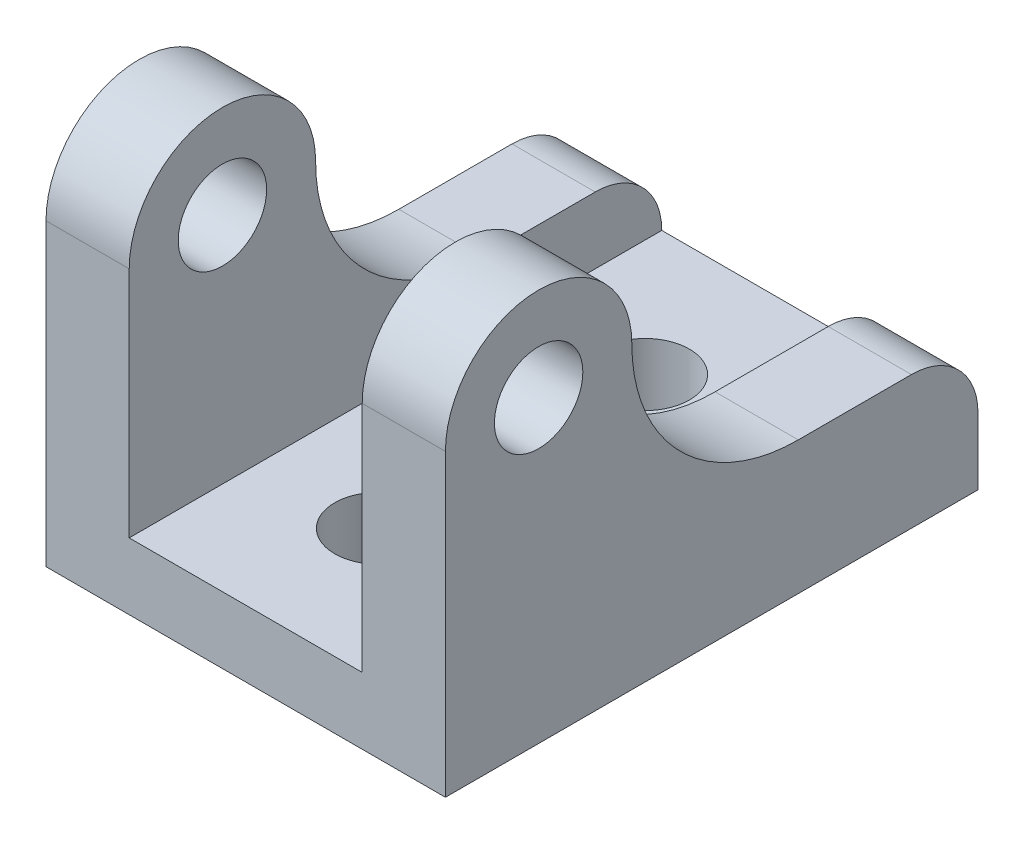
ISO-10303-21;
HEADER;
FILE_DESCRIPTION(('STEP AP214'),'2;1');
FILE_NAME('part.step','',(''),(''),'','','');
FILE_SCHEMA(('AUTOMOTIVE_DESIGN { 1 0 10303 214 1 1 1 1 }'));
ENDSEC;
DATA;
#1=APPLICATION_CONTEXT('core data for automotive mechanical design processes');
#2=APPLICATION_PROTOCOL_DEFINITION('international standard','automotive_design',2000,#1);
#3=PRODUCT_CONTEXT('',#1,'mechanical');
#4=PRODUCT('Part','Part','',(#3));
#5=PRODUCT_RELATED_PRODUCT_CATEGORY('part','',(#4));
#6=PRODUCT_DEFINITION_FORMATION('','',#4);
#7=PRODUCT_DEFINITION_CONTEXT('part definition',#1,'design');
#8=PRODUCT_DEFINITION('design','',#6,#7);
#9=PRODUCT_DEFINITION_SHAPE('','',#8);
#10=(LENGTH_UNIT() NAMED_UNIT(*) SI_UNIT(.MILLI.,.METRE.));
#11=(NAMED_UNIT(*) PLANE_ANGLE_UNIT() SI_UNIT($,.RADIAN.));
#12=(NAMED_UNIT(*) SI_UNIT($,.STERADIAN.) SOLID_ANGLE_UNIT());
#13=UNCERTAINTY_MEASURE_WITH_UNIT(LENGTH_MEASURE(1.E-05),#10,'distance_accuracy_value','');
#14=(GEOMETRIC_REPRESENTATION_CONTEXT(3) GLOBAL_UNCERTAINTY_ASSIGNED_CONTEXT((#13)) GLOBAL_UNIT_ASSIGNED_CONTEXT((#10,
#11,#12)) REPRESENTATION_CONTEXT('',''));
#15=CARTESIAN_POINT('',(0.,0.,0.));
#16=DIRECTION('',(0.,0.,1.));
#17=DIRECTION('',(1.,0.,0.));
#18=AXIS2_PLACEMENT_3D('',#15,#16,#17);
#19=CARTESIAN_POINT('',(19.05,0.,50.8));
#20=DIRECTION('',(-1.,0.,0.));
#21=DIRECTION('',(0.,-1.,0.));
#22=AXIS2_PLACEMENT_3D('',#19,#20,#21);
#23=PLANE('',#22);
#24=CARTESIAN_POINT('',(19.05,28.575,17.145));
#25=DIRECTION('',(1.,0.,0.));
#26=DIRECTION('',(0.,0.,-1.));
#27=AXIS2_PLACEMENT_3D('',#24,#25,#26);
#28=CIRCLE('',#27,15.875);
#29=CARTESIAN_POINT('',(19.05,28.575,33.02));
#30=VERTEX_POINT('',#29);
#31=CARTESIAN_POINT('',(19.05,12.7,17.145));
#32=VERTEX_POINT('',#31);
#33=EDGE_CURVE('E166',#30,#32,#28,.T.);
#34=ORIENTED_EDGE('',*,*,#33,.F.);
#35=CARTESIAN_POINT('',(19.05,28.575,41.91));
#36=DIRECTION('',(1.,0.,0.));
#37=DIRECTION('',(0.,0.,-1.));
#38=AXIS2_PLACEMENT_3D('',#35,#36,#37);
#39=CIRCLE('',#38,8.89);
#40=CARTESIAN_POINT('',(19.05,28.575,50.8));
#41=VERTEX_POINT('',#40);
#42=EDGE_CURVE('E163',#41,#30,#39,.F.);
#43=ORIENTED_EDGE('',*,*,#42,.F.);
#44=DIRECTION('',(0.,1.,0.));
#45=VECTOR('',#44,1.);
#46=CARTESIAN_POINT('',(19.05,0.,50.8));
#47=LINE('',#46,#45);
#48=CARTESIAN_POINT('',(19.05,0.,50.8));
#49=VERTEX_POINT('',#48);
#50=EDGE_CURVE('E230',#49,#41,#47,.T.);
#51=ORIENTED_EDGE('',*,*,#50,.F.);
#52=DIRECTION('',(0.,0.,-1.));
#53=VECTOR('',#52,1.);
#54=CARTESIAN_POINT('',(19.05,0.,50.8));
#55=LINE('',#54,#53);
#56=CARTESIAN_POINT('',(19.05,0.,0.));
#57=VERTEX_POINT('',#56);
#58=EDGE_CURVE('E243',#49,#57,#55,.T.);
#59=ORIENTED_EDGE('',*,*,#58,.T.);
#60=DIRECTION('',(0.,1.,0.));
#61=VECTOR('',#60,1.);
#62=CARTESIAN_POINT('',(19.05,0.,0.));
#63=LINE('',#62,#61);
#64=CARTESIAN_POINT('',(19.05,6.35,0.));
#65=VERTEX_POINT('',#64);
#66=EDGE_CURVE('E162',#57,#65,#63,.T.);
#67=ORIENTED_EDGE('',*,*,#66,.T.);
#68=CARTESIAN_POINT('',(19.05,6.35,6.34999999999999));
#69=DIRECTION('',(1.,0.,0.));
#70=DIRECTION('',(0.,0.,-1.));
#71=AXIS2_PLACEMENT_3D('',#68,#69,#70);
#72=CIRCLE('',#71,6.35);
#73=CARTESIAN_POINT('',(19.05,12.7,6.34999999999999));
#74=VERTEX_POINT('',#73);
#75=EDGE_CURVE('E48',#74,#65,#72,.F.);
#76=ORIENTED_EDGE('',*,*,#75,.F.);
#77=DIRECTION('',(0.,0.,-1.));
#78=VECTOR('',#77,1.);
#79=CARTESIAN_POINT('',(19.05,12.7,0.));
#80=LINE('',#79,#78);
#81=EDGE_CURVE('E150',#32,#74,#80,.T.);
#82=ORIENTED_EDGE('',*,*,#81,.F.);
#83=EDGE_LOOP('',(#34,#43,#51,#59,#67,#76,#82));
#84=FACE_BOUND('',#83,.T.);
#85=CARTESIAN_POINT('',(19.05,28.575,41.91));
#86=DIRECTION('',(1.,0.,0.));
#87=DIRECTION('',(0.,0.,-1.));
#88=AXIS2_PLACEMENT_3D('',#85,#86,#87);
#89=CIRCLE('',#88,4.2164);
#90=CARTESIAN_POINT('',(19.05,28.575,37.6936));
#91=VERTEX_POINT('',#90);
#92=EDGE_CURVE('E337',#91,#91,#89,.T.);
#93=ORIENTED_EDGE('',*,*,#92,.F.);
#94=EDGE_LOOP('',(#93));
#95=FACE_BOUND('',#94,.T.);
#96=ADVANCED_FACE('F33',(#84,#95),#23,.F.);
#97=CARTESIAN_POINT('',(-11.1125,50.8,50.8));
#98=DIRECTION('',(-1.,0.,0.));
#99=DIRECTION('',(0.,-1.,0.));
#100=AXIS2_PLACEMENT_3D('',#97,#98,#99);
#101=PLANE('',#100);
#102=CARTESIAN_POINT('',(-11.1125,28.575,41.91));
#103=DIRECTION('',(-1.,0.,0.));
#104=DIRECTION('',(0.,-1.,0.));
#105=AXIS2_PLACEMENT_3D('',#102,#103,#104);
#106=CIRCLE('',#105,4.21639999999999);
#107=CARTESIAN_POINT('',(-11.1125,24.3586,41.91));
#108=VERTEX_POINT('',#107);
#109=EDGE_CURVE('E340',#108,#108,#106,.T.);
#110=ORIENTED_EDGE('',*,*,#109,.T.);
#111=EDGE_LOOP('',(#110));
#112=FACE_BOUND('',#111,.T.);
#113=CARTESIAN_POINT('',(-11.1125,28.575,17.145));
#114=DIRECTION('',(-1.,0.,0.));
#115=DIRECTION('',(0.,-1.,0.));
#116=AXIS2_PLACEMENT_3D('',#113,#114,#115);
#117=CIRCLE('',#116,15.875);
#118=CARTESIAN_POINT('',(-11.1125,12.7,17.145));
#119=VERTEX_POINT('',#118);
#120=CARTESIAN_POINT('',(-11.1125,28.575,33.02));
#121=VERTEX_POINT('',#120);
#122=EDGE_CURVE('E204',#119,#121,#117,.T.);
#123=ORIENTED_EDGE('',*,*,#122,.T.);
#124=CARTESIAN_POINT('',(-11.1125,28.575,41.91));
#125=DIRECTION('',(-1.,0.,0.));
#126=DIRECTION('',(0.,-1.,0.));
#127=AXIS2_PLACEMENT_3D('',#124,#125,#126);
#128=CIRCLE('',#127,8.89);
#129=CARTESIAN_POINT('',(-11.1125,28.575,50.8));
#130=VERTEX_POINT('',#129);
#131=EDGE_CURVE('E202',#121,#130,#128,.F.);
#132=ORIENTED_EDGE('',*,*,#131,.T.);
#133=DIRECTION('',(0.,1.,0.));
#134=VECTOR('',#133,1.);
#135=CARTESIAN_POINT('',(-11.1125,50.8,50.8));
#136=LINE('',#135,#134);
#137=CARTESIAN_POINT('',(-11.1125,6.35,50.8));
#138=VERTEX_POINT('',#137);
#139=EDGE_CURVE('E85',#138,#130,#136,.T.);
#140=ORIENTED_EDGE('',*,*,#139,.F.);
#141=DIRECTION('',(0.,0.,-1.));
#142=VECTOR('',#141,1.);
#143=CARTESIAN_POINT('',(-11.1125,6.35,50.8));
#144=LINE('',#143,#142);
#145=CARTESIAN_POINT('',(-11.1125,6.35,0.));
#146=VERTEX_POINT('',#145);
#147=EDGE_CURVE('E247',#138,#146,#144,.T.);
#148=ORIENTED_EDGE('',*,*,#147,.T.);
#149=CARTESIAN_POINT('',(-11.1125,6.35,6.34999999999999));
#150=DIRECTION('',(-1.,0.,0.));
#151=DIRECTION('',(0.,-1.,0.));
#152=AXIS2_PLACEMENT_3D('',#149,#150,#151);
#153=CIRCLE('',#152,6.35);
#154=CARTESIAN_POINT('',(-11.1125,12.7,6.34999999999999));
#155=VERTEX_POINT('',#154);
#156=EDGE_CURVE('E196',#146,#155,#153,.F.);
#157=ORIENTED_EDGE('',*,*,#156,.T.);
#158=DIRECTION('',(0.,0.,1.));
#159=VECTOR('',#158,1.);
#160=CARTESIAN_POINT('',(-11.1125,12.7,50.8));
#161=LINE('',#160,#159);
#162=EDGE_CURVE('E207',#155,#119,#161,.T.);
#163=ORIENTED_EDGE('',*,*,#162,.T.);
#164=EDGE_LOOP('',(#123,#132,#140,#148,#157,#163));
#165=FACE_BOUND('',#164,.T.);
#166=ADVANCED_FACE('F291',(#112,#165),#101,.F.);
#167=CARTESIAN_POINT('',(-19.05,0.,50.8));
#168=DIRECTION('',(1.,0.,0.));
#169=DIRECTION('',(0.,1.,0.));
#170=AXIS2_PLACEMENT_3D('',#167,#168,#169);
#171=PLANE('',#170);
#172=CARTESIAN_POINT('',(-19.05,28.575,41.91));
#173=DIRECTION('',(1.,0.,0.));
#174=DIRECTION('',(0.,0.,-1.));
#175=AXIS2_PLACEMENT_3D('',#172,#173,#174);
#176=CIRCLE('',#175,4.21639999999999);
#177=CARTESIAN_POINT('',(-19.05,28.575,37.6936));
#178=VERTEX_POINT('',#177);
#179=EDGE_CURVE('E314',#178,#178,#176,.T.);
#180=ORIENTED_EDGE('',*,*,#179,.T.);
#181=EDGE_LOOP('',(#180));
#182=FACE_BOUND('',#181,.T.);
#183=DIRECTION('',(0.,-1.,0.));
#184=VECTOR('',#183,1.);
#185=CARTESIAN_POINT('',(-19.05,0.,50.8));
#186=LINE('',#185,#184);
#187=CARTESIAN_POINT('',(-19.05,28.575,50.8));
#188=VERTEX_POINT('',#187);
#189=CARTESIAN_POINT('',(-19.05,0.,50.8));
#190=VERTEX_POINT('',#189);
#191=EDGE_CURVE('E226',#188,#190,#186,.T.);
#192=ORIENTED_EDGE('',*,*,#191,.F.);
#193=CARTESIAN_POINT('',(-19.05,28.575,41.91));
#194=DIRECTION('',(1.,0.,0.));
#195=DIRECTION('',(0.,0.,-1.));
#196=AXIS2_PLACEMENT_3D('',#193,#194,#195);
#197=CIRCLE('',#196,8.89);
#198=CARTESIAN_POINT('',(-19.05,28.575,33.02));
#199=VERTEX_POINT('',#198);
#200=EDGE_CURVE('E177',#188,#199,#197,.F.);
#201=ORIENTED_EDGE('',*,*,#200,.T.);
#202=CARTESIAN_POINT('',(-19.05,28.575,17.145));
#203=DIRECTION('',(1.,0.,0.));
#204=DIRECTION('',(0.,0.,-1.));
#205=AXIS2_PLACEMENT_3D('',#202,#203,#204);
#206=CIRCLE('',#205,15.875);
#207=CARTESIAN_POINT('',(-19.05,12.7,17.145));
#208=VERTEX_POINT('',#207);
#209=EDGE_CURVE('E147',#199,#208,#206,.T.);
#210=ORIENTED_EDGE('',*,*,#209,.T.);
#211=DIRECTION('',(0.,0.,-1.));
#212=VECTOR('',#211,1.);
#213=CARTESIAN_POINT('',(-19.05,12.7,0.));
#214=LINE('',#213,#212);
#215=CARTESIAN_POINT('',(-19.05,12.7,6.34999999999999));
#216=VERTEX_POINT('',#215);
#217=EDGE_CURVE('E171',#208,#216,#214,.T.);
#218=ORIENTED_EDGE('',*,*,#217,.T.);
#219=CARTESIAN_POINT('',(-19.05,6.35,6.34999999999999));
#220=DIRECTION('',(1.,0.,0.));
#221=DIRECTION('',(0.,0.,-1.));
#222=AXIS2_PLACEMENT_3D('',#219,#220,#221);
#223=CIRCLE('',#222,6.35);
#224=CARTESIAN_POINT('',(-19.05,6.35,0.));
#225=VERTEX_POINT('',#224);
#226=EDGE_CURVE('E174',#216,#225,#223,.F.);
#227=ORIENTED_EDGE('',*,*,#226,.T.);
#228=DIRECTION('',(0.,-1.,0.));
#229=VECTOR('',#228,1.);
#230=CARTESIAN_POINT('',(-19.05,0.,0.));
#231=LINE('',#230,#229);
#232=CARTESIAN_POINT('',(-19.05,0.,0.));
#233=VERTEX_POINT('',#232);
#234=EDGE_CURVE('E237',#225,#233,#231,.T.);
#235=ORIENTED_EDGE('',*,*,#234,.T.);
#236=DIRECTION('',(0.,0.,-1.));
#237=VECTOR('',#236,1.);
#238=CARTESIAN_POINT('',(-19.05,0.,50.8));
#239=LINE('',#238,#237);
#240=EDGE_CURVE('E245',#190,#233,#239,.T.);
#241=ORIENTED_EDGE('',*,*,#240,.F.);
#242=EDGE_LOOP('',(#192,#201,#210,#218,#227,#235,#241));
#243=FACE_BOUND('',#242,.T.);
#244=ADVANCED_FACE('F296',(#182,#243),#171,.F.);
#245=CARTESIAN_POINT('',(11.1125,50.8,50.8));
#246=DIRECTION('',(1.,0.,0.));
#247=DIRECTION('',(0.,1.,0.));
#248=AXIS2_PLACEMENT_3D('',#245,#246,#247);
#249=PLANE('',#248);
#250=CARTESIAN_POINT('',(11.1125,28.575,41.91));
#251=DIRECTION('',(1.,0.,0.));
#252=DIRECTION('',(0.,1.,0.));
#253=AXIS2_PLACEMENT_3D('',#250,#251,#252);
#254=CIRCLE('',#253,4.21639999999999);
#255=CARTESIAN_POINT('',(11.1125,32.7914,41.91));
#256=VERTEX_POINT('',#255);
#257=EDGE_CURVE('E157',#256,#256,#254,.T.);
#258=ORIENTED_EDGE('',*,*,#257,.T.);
#259=EDGE_LOOP('',(#258));
#260=FACE_BOUND('',#259,.T.);
#261=DIRECTION('',(0.,-1.,0.));
#262=VECTOR('',#261,1.);
#263=CARTESIAN_POINT('',(11.1125,50.8,50.8));
#264=LINE('',#263,#262);
#265=CARTESIAN_POINT('',(11.1125,28.575,50.8));
#266=VERTEX_POINT('',#265);
#267=CARTESIAN_POINT('',(11.1125,6.35,50.8));
#268=VERTEX_POINT('',#267);
#269=EDGE_CURVE('E57',#266,#268,#264,.T.);
#270=ORIENTED_EDGE('',*,*,#269,.F.);
#271=CARTESIAN_POINT('',(11.1125,28.575,41.91));
#272=DIRECTION('',(1.,0.,0.));
#273=DIRECTION('',(0.,1.,0.));
#274=AXIS2_PLACEMENT_3D('',#271,#272,#273);
#275=CIRCLE('',#274,8.89);
#276=CARTESIAN_POINT('',(11.1125,28.575,33.02));
#277=VERTEX_POINT('',#276);
#278=EDGE_CURVE('E199',#266,#277,#275,.F.);
#279=ORIENTED_EDGE('',*,*,#278,.T.);
#280=CARTESIAN_POINT('',(11.1125,28.575,17.145));
#281=DIRECTION('',(1.,0.,0.));
#282=DIRECTION('',(0.,1.,0.));
#283=AXIS2_PLACEMENT_3D('',#280,#281,#282);
#284=CIRCLE('',#283,15.875);
#285=CARTESIAN_POINT('',(11.1125,12.7,17.145));
#286=VERTEX_POINT('',#285);
#287=EDGE_CURVE('E11',#277,#286,#284,.T.);
#288=ORIENTED_EDGE('',*,*,#287,.T.);
#289=DIRECTION('',(0.,0.,-1.));
#290=VECTOR('',#289,1.);
#291=CARTESIAN_POINT('',(11.1125,12.7,50.8));
#292=LINE('',#291,#290);
#293=CARTESIAN_POINT('',(11.1125,12.7,6.34999999999999));
#294=VERTEX_POINT('',#293);
#295=EDGE_CURVE('E41',#286,#294,#292,.T.);
#296=ORIENTED_EDGE('',*,*,#295,.T.);
#297=CARTESIAN_POINT('',(11.1125,6.35,6.34999999999999));
#298=DIRECTION('',(1.,0.,0.));
#299=DIRECTION('',(0.,1.,0.));
#300=AXIS2_PLACEMENT_3D('',#297,#298,#299);
#301=CIRCLE('',#300,6.35);
#302=CARTESIAN_POINT('',(11.1125,6.35,0.));
#303=VERTEX_POINT('',#302);
#304=EDGE_CURVE('E143',#294,#303,#301,.F.);
#305=ORIENTED_EDGE('',*,*,#304,.T.);
#306=DIRECTION('',(0.,0.,-1.));
#307=VECTOR('',#306,1.);
#308=CARTESIAN_POINT('',(11.1125,6.35,50.8));
#309=LINE('',#308,#307);
#310=EDGE_CURVE('E234',#268,#303,#309,.T.);
#311=ORIENTED_EDGE('',*,*,#310,.F.);
#312=EDGE_LOOP('',(#270,#279,#288,#296,#305,#311));
#313=FACE_BOUND('',#312,.T.);
#314=ADVANCED_FACE('F253',(#260,#313),#249,.F.);
#315=CARTESIAN_POINT('',(0.,0.,50.8));
#316=DIRECTION('',(0.,0.,1.));
#317=DIRECTION('',(1.,0.,0.));
#318=AXIS2_PLACEMENT_3D('',#315,#316,#317);
#319=PLANE('',#318);
#320=ORIENTED_EDGE('',*,*,#50,.T.);
#321=DIRECTION('',(1.,0.,0.));
#322=VECTOR('',#321,1.);
#323=CARTESIAN_POINT('',(-19.05,28.575,50.8));
#324=LINE('',#323,#322);
#325=EDGE_CURVE('E251',#41,#266,#324,.F.);
#326=ORIENTED_EDGE('',*,*,#325,.T.);
#327=ORIENTED_EDGE('',*,*,#269,.T.);
#328=DIRECTION('',(-1.,0.,0.));
#329=VECTOR('',#328,1.);
#330=CARTESIAN_POINT('',(11.1125,6.35,50.8));
#331=LINE('',#330,#329);
#332=EDGE_CURVE('E223',#268,#138,#331,.T.);
#333=ORIENTED_EDGE('',*,*,#332,.T.);
#334=ORIENTED_EDGE('',*,*,#139,.T.);
#335=DIRECTION('',(1.,0.,0.));
#336=VECTOR('',#335,1.);
#337=CARTESIAN_POINT('',(-19.05,28.575,50.8));
#338=LINE('',#337,#336);
#339=EDGE_CURVE('E189',#188,#130,#338,.T.);
#340=ORIENTED_EDGE('',*,*,#339,.F.);
#341=ORIENTED_EDGE('',*,*,#191,.T.);
#342=DIRECTION('',(1.,0.,0.));
#343=VECTOR('',#342,1.);
#344=CARTESIAN_POINT('',(-19.05,0.,50.8));
#345=LINE('',#344,#343);
#346=EDGE_CURVE('E228',#190,#49,#345,.T.);
#347=ORIENTED_EDGE('',*,*,#346,.T.);
#348=EDGE_LOOP('',(#320,#326,#327,#333,#334,#340,#341,#347));
#349=FACE_BOUND('',#348,.T.);
#350=ADVANCED_FACE('F260',(#349),#319,.T.);
#351=CARTESIAN_POINT('',(0.,0.,0.));
#352=DIRECTION('',(0.,0.,1.));
#353=DIRECTION('',(1.,0.,0.));
#354=AXIS2_PLACEMENT_3D('',#351,#352,#353);
#355=PLANE('',#354);
#356=DIRECTION('',(1.,0.,0.));
#357=VECTOR('',#356,1.);
#358=CARTESIAN_POINT('',(-19.05,6.35,0.));
#359=LINE('',#358,#357);
#360=EDGE_CURVE('E249',#65,#303,#359,.F.);
#361=ORIENTED_EDGE('',*,*,#360,.F.);
#362=ORIENTED_EDGE('',*,*,#66,.F.);
#363=DIRECTION('',(1.,0.,0.));
#364=VECTOR('',#363,1.);
#365=CARTESIAN_POINT('',(-19.05,0.,0.));
#366=LINE('',#365,#364);
#367=EDGE_CURVE('E77',#233,#57,#366,.T.);
#368=ORIENTED_EDGE('',*,*,#367,.F.);
#369=ORIENTED_EDGE('',*,*,#234,.F.);
#370=DIRECTION('',(1.,0.,0.));
#371=VECTOR('',#370,1.);
#372=CARTESIAN_POINT('',(-19.05,6.35,0.));
#373=LINE('',#372,#371);
#374=EDGE_CURVE('E191',#225,#146,#373,.T.);
#375=ORIENTED_EDGE('',*,*,#374,.T.);
#376=DIRECTION('',(-1.,0.,0.));
#377=VECTOR('',#376,1.);
#378=CARTESIAN_POINT('',(11.1125,6.35,0.));
#379=LINE('',#378,#377);
#380=EDGE_CURVE('E222',#303,#146,#379,.T.);
#381=ORIENTED_EDGE('',*,*,#380,.F.);
#382=EDGE_LOOP('',(#361,#362,#368,#369,#375,#381));
#383=FACE_BOUND('',#382,.T.);
#384=ADVANCED_FACE('F267',(#383),#355,.F.);
#385=CARTESIAN_POINT('',(11.1125,6.35,50.8));
#386=DIRECTION('',(0.,-1.,0.));
#387=DIRECTION('',(1.,0.,0.));
#388=AXIS2_PLACEMENT_3D('',#385,#386,#387);
#389=PLANE('',#388);
#390=CARTESIAN_POINT('',(0.,6.35,38.1));
#391=DIRECTION('',(0.,1.,0.));
#392=DIRECTION('',(0.,0.,1.));
#393=AXIS2_PLACEMENT_3D('',#390,#391,#392);
#394=CIRCLE('',#393,4.2164);
#395=CARTESIAN_POINT('',(0.,6.35,42.3164));
#396=VERTEX_POINT('',#395);
#397=EDGE_CURVE('E210',#396,#396,#394,.T.);
#398=ORIENTED_EDGE('',*,*,#397,.F.);
#399=EDGE_LOOP('',(#398));
#400=FACE_BOUND('',#399,.T.);
#401=ORIENTED_EDGE('',*,*,#380,.T.);
#402=ORIENTED_EDGE('',*,*,#147,.F.);
#403=ORIENTED_EDGE('',*,*,#332,.F.);
#404=ORIENTED_EDGE('',*,*,#310,.T.);
#405=EDGE_LOOP('',(#401,#402,#403,#404));
#406=FACE_BOUND('',#405,.T.);
#407=CARTESIAN_POINT('',(0.,6.35,12.7));
#408=DIRECTION('',(0.,1.,0.));
#409=DIRECTION('',(0.,0.,1.));
#410=AXIS2_PLACEMENT_3D('',#407,#408,#409);
#411=CIRCLE('',#410,4.2164);
#412=CARTESIAN_POINT('',(0.,6.35,16.9164));
#413=VERTEX_POINT('',#412);
#414=EDGE_CURVE('E216',#413,#413,#411,.T.);
#415=ORIENTED_EDGE('',*,*,#414,.F.);
#416=EDGE_LOOP('',(#415));
#417=FACE_BOUND('',#416,.T.);
#418=ADVANCED_FACE('F35',(#400,#406,#417),#389,.F.);
#419=CARTESIAN_POINT('',(-19.05,0.,50.8));
#420=DIRECTION('',(0.,1.,0.));
#421=DIRECTION('',(-1.,0.,0.));
#422=AXIS2_PLACEMENT_3D('',#419,#420,#421);
#423=PLANE('',#422);
#424=CARTESIAN_POINT('',(0.,0.,38.1));
#425=DIRECTION('',(0.,1.,0.));
#426=DIRECTION('',(0.,0.,1.));
#427=AXIS2_PLACEMENT_3D('',#424,#425,#426);
#428=CIRCLE('',#427,4.2164);
#429=CARTESIAN_POINT('',(0.,0.,42.3164));
#430=VERTEX_POINT('',#429);
#431=EDGE_CURVE('E213',#430,#430,#428,.T.);
#432=ORIENTED_EDGE('',*,*,#431,.T.);
#433=EDGE_LOOP('',(#432));
#434=FACE_BOUND('',#433,.T.);
#435=CARTESIAN_POINT('',(0.,0.,12.7));
#436=DIRECTION('',(0.,1.,0.));
#437=DIRECTION('',(0.,0.,1.));
#438=AXIS2_PLACEMENT_3D('',#435,#436,#437);
#439=CIRCLE('',#438,4.2164);
#440=CARTESIAN_POINT('',(0.,0.,16.9164));
#441=VERTEX_POINT('',#440);
#442=EDGE_CURVE('E219',#441,#441,#439,.T.);
#443=ORIENTED_EDGE('',*,*,#442,.T.);
#444=EDGE_LOOP('',(#443));
#445=FACE_BOUND('',#444,.T.);
#446=ORIENTED_EDGE('',*,*,#367,.T.);
#447=ORIENTED_EDGE('',*,*,#58,.F.);
#448=ORIENTED_EDGE('',*,*,#346,.F.);
#449=ORIENTED_EDGE('',*,*,#240,.T.);
#450=EDGE_LOOP('',(#446,#447,#448,#449));
#451=FACE_BOUND('',#450,.T.);
#452=ADVANCED_FACE('F265',(#434,#445,#451),#423,.F.);
#453=CARTESIAN_POINT('',(0.,6.35,12.7));
#454=DIRECTION('',(0.,1.,0.));
#455=DIRECTION('',(0.,0.,1.));
#456=AXIS2_PLACEMENT_3D('',#453,#454,#455);
#457=CYLINDRICAL_SURFACE('',#456,4.2164);
#458=ORIENTED_EDGE('',*,*,#442,.F.);
#459=EDGE_LOOP('',(#458));
#460=FACE_BOUND('',#459,.T.);
#461=ORIENTED_EDGE('',*,*,#414,.T.);
#462=EDGE_LOOP('',(#461));
#463=FACE_BOUND('',#462,.T.);
#464=ADVANCED_FACE('F303',(#460,#463),#457,.F.);
#465=CARTESIAN_POINT('',(0.,6.35,38.1));
#466=DIRECTION('',(0.,1.,0.));
#467=DIRECTION('',(0.,0.,1.));
#468=AXIS2_PLACEMENT_3D('',#465,#466,#467);
#469=CYLINDRICAL_SURFACE('',#468,4.2164);
#470=ORIENTED_EDGE('',*,*,#431,.F.);
#471=EDGE_LOOP('',(#470));
#472=FACE_BOUND('',#471,.T.);
#473=ORIENTED_EDGE('',*,*,#397,.T.);
#474=EDGE_LOOP('',(#473));
#475=FACE_BOUND('',#474,.T.);
#476=ADVANCED_FACE('F288',(#472,#475),#469,.F.);
#477=CARTESIAN_POINT('',(-19.05,28.575,41.91));
#478=DIRECTION('',(1.,0.,0.));
#479=DIRECTION('',(0.,0.,-1.));
#480=AXIS2_PLACEMENT_3D('',#477,#478,#479);
#481=CYLINDRICAL_SURFACE('',#480,8.89);
#482=DIRECTION('',(1.,0.,0.));
#483=VECTOR('',#482,1.);
#484=CARTESIAN_POINT('',(-19.05,28.575,33.02));
#485=LINE('',#484,#483);
#486=EDGE_CURVE('E185',#199,#121,#485,.T.);
#487=ORIENTED_EDGE('',*,*,#486,.F.);
#488=ORIENTED_EDGE('',*,*,#200,.F.);
#489=ORIENTED_EDGE('',*,*,#339,.T.);
#490=ORIENTED_EDGE('',*,*,#131,.F.);
#491=EDGE_LOOP('',(#487,#488,#489,#490));
#492=FACE_BOUND('',#491,.T.);
#493=ADVANCED_FACE('F277',(#492),#481,.T.);
#494=CARTESIAN_POINT('',(-19.05,28.575,17.145));
#495=DIRECTION('',(1.,0.,0.));
#496=DIRECTION('',(0.,0.,-1.));
#497=AXIS2_PLACEMENT_3D('',#494,#495,#496);
#498=CYLINDRICAL_SURFACE('',#497,15.875);
#499=DIRECTION('',(1.,0.,0.));
#500=VECTOR('',#499,1.);
#501=CARTESIAN_POINT('',(-19.05,12.7,17.145));
#502=LINE('',#501,#500);
#503=EDGE_CURVE('E182',#208,#119,#502,.T.);
#504=ORIENTED_EDGE('',*,*,#503,.F.);
#505=ORIENTED_EDGE('',*,*,#209,.F.);
#506=ORIENTED_EDGE('',*,*,#486,.T.);
#507=ORIENTED_EDGE('',*,*,#122,.F.);
#508=EDGE_LOOP('',(#504,#505,#506,#507));
#509=FACE_BOUND('',#508,.T.);
#510=ADVANCED_FACE('F286',(#509),#498,.F.);
#511=CARTESIAN_POINT('',(-19.05,6.35,6.34999999999999));
#512=DIRECTION('',(1.,0.,0.));
#513=DIRECTION('',(0.,0.,-1.));
#514=AXIS2_PLACEMENT_3D('',#511,#512,#513);
#515=CYLINDRICAL_SURFACE('',#514,6.35);
#516=ORIENTED_EDGE('',*,*,#374,.F.);
#517=ORIENTED_EDGE('',*,*,#226,.F.);
#518=DIRECTION('',(1.,0.,0.));
#519=VECTOR('',#518,1.);
#520=CARTESIAN_POINT('',(-19.05,12.7,6.34999999999999));
#521=LINE('',#520,#519);
#522=EDGE_CURVE('E146',#216,#155,#521,.T.);
#523=ORIENTED_EDGE('',*,*,#522,.T.);
#524=ORIENTED_EDGE('',*,*,#156,.F.);
#525=EDGE_LOOP('',(#516,#517,#523,#524));
#526=FACE_BOUND('',#525,.T.);
#527=ADVANCED_FACE('F284',(#526),#515,.T.);
#528=CARTESIAN_POINT('',(-19.05,12.7,0.));
#529=DIRECTION('',(0.,-1.,0.));
#530=DIRECTION('',(0.,0.,-1.));
#531=AXIS2_PLACEMENT_3D('',#528,#529,#530);
#532=PLANE('',#531);
#533=ORIENTED_EDGE('',*,*,#522,.F.);
#534=ORIENTED_EDGE('',*,*,#217,.F.);
#535=ORIENTED_EDGE('',*,*,#503,.T.);
#536=ORIENTED_EDGE('',*,*,#162,.F.);
#537=EDGE_LOOP('',(#533,#534,#535,#536));
#538=FACE_BOUND('',#537,.T.);
#539=ADVANCED_FACE('F319',(#538),#532,.F.);
#540=EDGE_CURVE('E153',#286,#32,#502,.T.);
#541=ORIENTED_EDGE('',*,*,#540,.T.);
#542=ORIENTED_EDGE('',*,*,#81,.T.);
#543=EDGE_CURVE('E139',#294,#74,#521,.T.);
#544=ORIENTED_EDGE('',*,*,#543,.F.);
#545=ORIENTED_EDGE('',*,*,#295,.F.);
#546=EDGE_LOOP('',(#541,#542,#544,#545));
#547=FACE_BOUND('',#546,.T.);
#548=ADVANCED_FACE('F151',(#547),#532,.F.);
#549=EDGE_CURVE('E188',#277,#30,#485,.T.);
#550=ORIENTED_EDGE('',*,*,#549,.T.);
#551=ORIENTED_EDGE('',*,*,#33,.T.);
#552=ORIENTED_EDGE('',*,*,#540,.F.);
#553=ORIENTED_EDGE('',*,*,#287,.F.);
#554=EDGE_LOOP('',(#550,#551,#552,#553));
#555=FACE_BOUND('',#554,.T.);
#556=ADVANCED_FACE('F255',(#555),#498,.F.);
#557=ORIENTED_EDGE('',*,*,#325,.F.);
#558=ORIENTED_EDGE('',*,*,#42,.T.);
#559=ORIENTED_EDGE('',*,*,#549,.F.);
#560=ORIENTED_EDGE('',*,*,#278,.F.);
#561=EDGE_LOOP('',(#557,#558,#559,#560));
#562=FACE_BOUND('',#561,.T.);
#563=ADVANCED_FACE('F274',(#562),#481,.T.);
#564=ORIENTED_EDGE('',*,*,#543,.T.);
#565=ORIENTED_EDGE('',*,*,#75,.T.);
#566=ORIENTED_EDGE('',*,*,#360,.T.);
#567=ORIENTED_EDGE('',*,*,#304,.F.);
#568=EDGE_LOOP('',(#564,#565,#566,#567));
#569=FACE_BOUND('',#568,.T.);
#570=ADVANCED_FACE('F141',(#569),#515,.T.);
#571=CARTESIAN_POINT('',(19.05,28.575,41.91));
#572=DIRECTION('',(1.,0.,0.));
#573=DIRECTION('',(0.,0.,-1.));
#574=AXIS2_PLACEMENT_3D('',#571,#572,#573);
#575=CYLINDRICAL_SURFACE('',#574,4.21639999999999);
#576=ORIENTED_EDGE('',*,*,#92,.T.);
#577=EDGE_LOOP('',(#576));
#578=FACE_BOUND('',#577,.T.);
#579=ORIENTED_EDGE('',*,*,#257,.F.);
#580=EDGE_LOOP('',(#579));
#581=FACE_BOUND('',#580,.T.);
#582=ADVANCED_FACE('F282',(#578,#581),#575,.F.);
#583=ORIENTED_EDGE('',*,*,#179,.F.);
#584=EDGE_LOOP('',(#583));
#585=FACE_BOUND('',#584,.T.);
#586=ORIENTED_EDGE('',*,*,#109,.F.);
#587=EDGE_LOOP('',(#586));
#588=FACE_BOUND('',#587,.T.);
#589=ADVANCED_FACE('F328',(#585,#588),#575,.F.);
#590=CLOSED_SHELL('',(#96,#166,#244,#314,#350,#384,#418,#452,#464,#476,#493,#510,#527,#539,#548,
#556,#563,#570,#582,#589));
#591=MANIFOLD_SOLID_BREP('B2',#590);
#592=ADVANCED_BREP_SHAPE_REPRESENTATION('',(#18,#591),#14);
#593=SHAPE_DEFINITION_REPRESENTATION(#9,#592);
ENDSEC;
END-ISO-10303-21;
